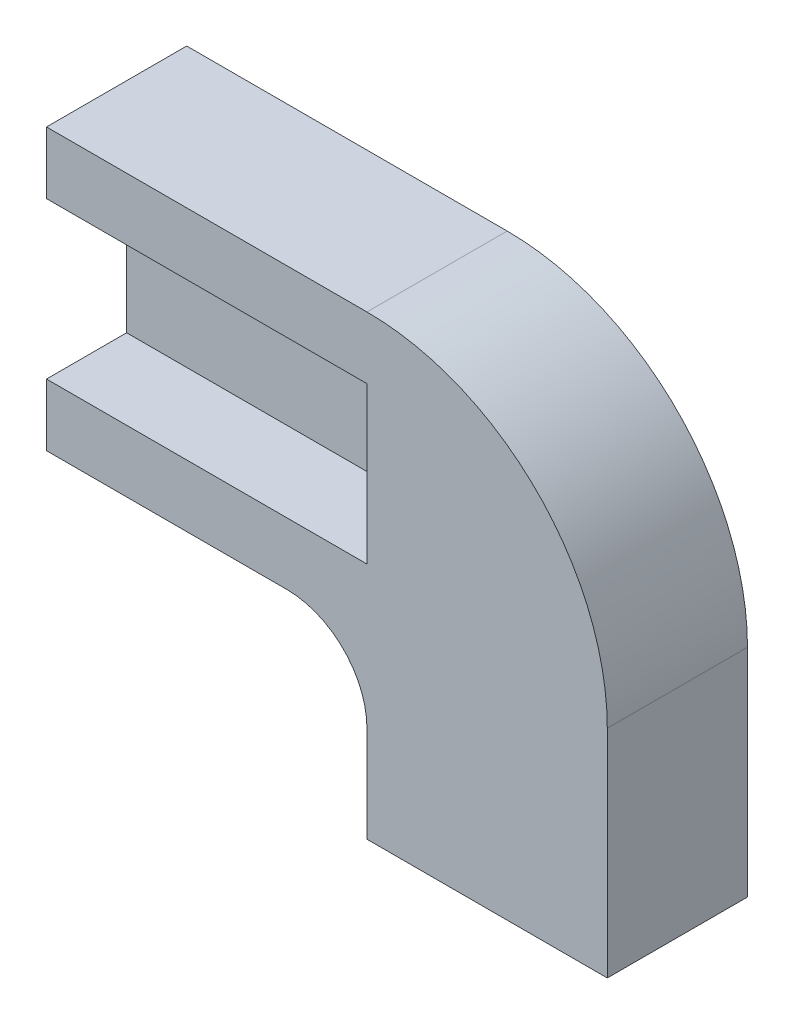
ISO-10303-21;
HEADER;
FILE_DESCRIPTION(('STEP AP214'),'2;1');
FILE_NAME('part.step','',(''),(''),'','','');
FILE_SCHEMA(('AUTOMOTIVE_DESIGN { 1 0 10303 214 1 1 1 1 }'));
ENDSEC;
DATA;
#1=APPLICATION_CONTEXT('core data for automotive mechanical design processes');
#2=APPLICATION_PROTOCOL_DEFINITION('international standard','automotive_design',2000,#1);
#3=PRODUCT_CONTEXT('',#1,'mechanical');
#4=PRODUCT('Part','Part','',(#3));
#5=PRODUCT_RELATED_PRODUCT_CATEGORY('part','',(#4));
#6=PRODUCT_DEFINITION_FORMATION('','',#4);
#7=PRODUCT_DEFINITION_CONTEXT('part definition',#1,'design');
#8=PRODUCT_DEFINITION('design','',#6,#7);
#9=PRODUCT_DEFINITION_SHAPE('','',#8);
#10=(LENGTH_UNIT() NAMED_UNIT(*) SI_UNIT(.MILLI.,.METRE.));
#11=(NAMED_UNIT(*) PLANE_ANGLE_UNIT() SI_UNIT($,.RADIAN.));
#12=(NAMED_UNIT(*) SI_UNIT($,.STERADIAN.) SOLID_ANGLE_UNIT());
#13=UNCERTAINTY_MEASURE_WITH_UNIT(LENGTH_MEASURE(1.E-05),#10,'distance_accuracy_value','');
#14=(GEOMETRIC_REPRESENTATION_CONTEXT(3) GLOBAL_UNCERTAINTY_ASSIGNED_CONTEXT((#13)) GLOBAL_UNIT_ASSIGNED_CONTEXT((#10,
#11,#12)) REPRESENTATION_CONTEXT('',''));
#15=CARTESIAN_POINT('',(0.,0.,0.));
#16=DIRECTION('',(0.,0.,1.));
#17=DIRECTION('',(1.,0.,0.));
#18=AXIS2_PLACEMENT_3D('',#15,#16,#17);
#19=CARTESIAN_POINT('',(17.78,0.,0.));
#20=DIRECTION('',(0.,1.,0.));
#21=DIRECTION('',(0.,0.,1.));
#22=AXIS2_PLACEMENT_3D('',#19,#20,#21);
#23=PLANE('',#22);
#24=DIRECTION('',(-1.,0.,0.));
#25=VECTOR('',#24,1.);
#26=CARTESIAN_POINT('',(17.78,0.,4.445));
#27=LINE('',#26,#25);
#28=CARTESIAN_POINT('',(10.16,0.,4.445));
#29=VERTEX_POINT('',#28);
#30=CARTESIAN_POINT('',(0.,0.,4.445));
#31=VERTEX_POINT('',#30);
#32=EDGE_CURVE('E172',#29,#31,#27,.T.);
#33=ORIENTED_EDGE('',*,*,#32,.F.);
#34=DIRECTION('',(0.,0.,1.));
#35=VECTOR('',#34,1.);
#36=CARTESIAN_POINT('',(10.16,0.,0.));
#37=LINE('',#36,#35);
#38=CARTESIAN_POINT('',(10.16,0.,0.));
#39=VERTEX_POINT('',#38);
#40=EDGE_CURVE('E41',#29,#39,#37,.F.);
#41=ORIENTED_EDGE('',*,*,#40,.T.);
#42=DIRECTION('',(-1.,0.,0.));
#43=VECTOR('',#42,1.);
#44=CARTESIAN_POINT('',(17.78,0.,0.));
#45=LINE('',#44,#43);
#46=CARTESIAN_POINT('',(0.,0.,0.));
#47=VERTEX_POINT('',#46);
#48=EDGE_CURVE('E174',#39,#47,#45,.T.);
#49=ORIENTED_EDGE('',*,*,#48,.T.);
#50=DIRECTION('',(0.,0.,1.));
#51=VECTOR('',#50,1.);
#52=CARTESIAN_POINT('',(0.,0.,0.));
#53=LINE('',#52,#51);
#54=EDGE_CURVE('E185',#47,#31,#53,.T.);
#55=ORIENTED_EDGE('',*,*,#54,.T.);
#56=EDGE_LOOP('',(#33,#41,#49,#55));
#57=FACE_BOUND('',#56,.T.);
#58=ADVANCED_FACE('F33',(#57),#23,.T.);
#59=CARTESIAN_POINT('',(17.78,-14.478,0.));
#60=DIRECTION('',(1.,0.,0.));
#61=DIRECTION('',(0.,0.,-1.));
#62=AXIS2_PLACEMENT_3D('',#59,#60,#61);
#63=PLANE('',#62);
#64=DIRECTION('',(0.,1.,0.));
#65=VECTOR('',#64,1.);
#66=CARTESIAN_POINT('',(17.78,-14.478,0.));
#67=LINE('',#66,#65);
#68=CARTESIAN_POINT('',(17.78,-14.478,0.));
#69=VERTEX_POINT('',#68);
#70=CARTESIAN_POINT('',(17.78,-7.62,0.));
#71=VERTEX_POINT('',#70);
#72=EDGE_CURVE('E182',#69,#71,#67,.T.);
#73=ORIENTED_EDGE('',*,*,#72,.T.);
#74=DIRECTION('',(0.,0.,1.));
#75=VECTOR('',#74,1.);
#76=CARTESIAN_POINT('',(17.78,-7.62,0.));
#77=LINE('',#76,#75);
#78=CARTESIAN_POINT('',(17.78,-7.62,4.445));
#79=VERTEX_POINT('',#78);
#80=EDGE_CURVE('E208',#71,#79,#77,.T.);
#81=ORIENTED_EDGE('',*,*,#80,.T.);
#82=DIRECTION('',(0.,1.,0.));
#83=VECTOR('',#82,1.);
#84=CARTESIAN_POINT('',(17.78,-14.478,4.445));
#85=LINE('',#84,#83);
#86=CARTESIAN_POINT('',(17.78,-14.478,4.445));
#87=VERTEX_POINT('',#86);
#88=EDGE_CURVE('E177',#87,#79,#85,.T.);
#89=ORIENTED_EDGE('',*,*,#88,.F.);
#90=DIRECTION('',(0.,0.,1.));
#91=VECTOR('',#90,1.);
#92=CARTESIAN_POINT('',(17.78,-14.478,0.));
#93=LINE('',#92,#91);
#94=EDGE_CURVE('E194',#69,#87,#93,.T.);
#95=ORIENTED_EDGE('',*,*,#94,.F.);
#96=EDGE_LOOP('',(#73,#81,#89,#95));
#97=FACE_BOUND('',#96,.T.);
#98=ADVANCED_FACE('F214',(#97),#63,.T.);
#99=CARTESIAN_POINT('',(0.,-14.478,0.));
#100=DIRECTION('',(0.,-1.,0.));
#101=DIRECTION('',(1.,0.,0.));
#102=AXIS2_PLACEMENT_3D('',#99,#100,#101);
#103=PLANE('',#102);
#104=DIRECTION('',(0.,0.,-1.));
#105=VECTOR('',#104,1.);
#106=CARTESIAN_POINT('',(10.16,-14.478,4.445));
#107=LINE('',#106,#105);
#108=CARTESIAN_POINT('',(10.16,-14.478,4.445));
#109=VERTEX_POINT('',#108);
#110=CARTESIAN_POINT('',(10.16,-14.478,0.));
#111=VERTEX_POINT('',#110);
#112=EDGE_CURVE('E169',#109,#111,#107,.T.);
#113=ORIENTED_EDGE('',*,*,#112,.T.);
#114=DIRECTION('',(1.,0.,0.));
#115=VECTOR('',#114,1.);
#116=CARTESIAN_POINT('',(0.,-14.478,0.));
#117=LINE('',#116,#115);
#118=EDGE_CURVE('E180',#111,#69,#117,.T.);
#119=ORIENTED_EDGE('',*,*,#118,.T.);
#120=ORIENTED_EDGE('',*,*,#94,.T.);
#121=DIRECTION('',(1.,0.,0.));
#122=VECTOR('',#121,1.);
#123=CARTESIAN_POINT('',(0.,-14.478,4.445));
#124=LINE('',#123,#122);
#125=EDGE_CURVE('E191',#109,#87,#124,.T.);
#126=ORIENTED_EDGE('',*,*,#125,.F.);
#127=EDGE_LOOP('',(#113,#119,#120,#126));
#128=FACE_BOUND('',#127,.T.);
#129=ADVANCED_FACE('F224',(#128),#103,.T.);
#130=CARTESIAN_POINT('',(0.,0.,0.));
#131=DIRECTION('',(-1.,0.,0.));
#132=DIRECTION('',(0.,0.,1.));
#133=AXIS2_PLACEMENT_3D('',#130,#131,#132);
#134=PLANE('',#133);
#135=DIRECTION('',(0.,0.,1.));
#136=VECTOR('',#135,1.);
#137=CARTESIAN_POINT('',(0.,-6.9215,1.905));
#138=LINE('',#137,#136);
#139=CARTESIAN_POINT('',(0.,-6.9215,1.905));
#140=VERTEX_POINT('',#139);
#141=CARTESIAN_POINT('',(0.,-6.9215,4.445));
#142=VERTEX_POINT('',#141);
#143=EDGE_CURVE('E156',#140,#142,#138,.T.);
#144=ORIENTED_EDGE('',*,*,#143,.F.);
#145=DIRECTION('',(0.,-1.,0.));
#146=VECTOR('',#145,1.);
#147=CARTESIAN_POINT('',(0.,-1.9685,1.905));
#148=LINE('',#147,#146);
#149=CARTESIAN_POINT('',(0.,-1.9685,1.905));
#150=VERTEX_POINT('',#149);
#151=EDGE_CURVE('E139',#150,#140,#148,.T.);
#152=ORIENTED_EDGE('',*,*,#151,.F.);
#153=DIRECTION('',(0.,0.,1.));
#154=VECTOR('',#153,1.);
#155=CARTESIAN_POINT('',(0.,-1.9685,1.905));
#156=LINE('',#155,#154);
#157=CARTESIAN_POINT('',(0.,-1.9685,4.445));
#158=VERTEX_POINT('',#157);
#159=EDGE_CURVE('E130',#150,#158,#156,.T.);
#160=ORIENTED_EDGE('',*,*,#159,.T.);
#161=DIRECTION('',(0.,-1.,0.));
#162=VECTOR('',#161,1.);
#163=CARTESIAN_POINT('',(0.,0.,4.445));
#164=LINE('',#163,#162);
#165=EDGE_CURVE('E188',#31,#158,#164,.T.);
#166=ORIENTED_EDGE('',*,*,#165,.F.);
#167=ORIENTED_EDGE('',*,*,#54,.F.);
#168=DIRECTION('',(0.,-1.,0.));
#169=VECTOR('',#168,1.);
#170=CARTESIAN_POINT('',(0.,0.,0.));
#171=LINE('',#170,#169);
#172=CARTESIAN_POINT('',(0.,-8.89,0.));
#173=VERTEX_POINT('',#172);
#174=EDGE_CURVE('E176',#47,#173,#171,.T.);
#175=ORIENTED_EDGE('',*,*,#174,.T.);
#176=DIRECTION('',(0.,0.,-1.));
#177=VECTOR('',#176,1.);
#178=CARTESIAN_POINT('',(0.,-8.89,4.445));
#179=LINE('',#178,#177);
#180=CARTESIAN_POINT('',(0.,-8.89,4.445));
#181=VERTEX_POINT('',#180);
#182=EDGE_CURVE('E165',#181,#173,#179,.T.);
#183=ORIENTED_EDGE('',*,*,#182,.F.);
#184=EDGE_CURVE('E187',#142,#181,#164,.T.);
#185=ORIENTED_EDGE('',*,*,#184,.F.);
#186=EDGE_LOOP('',(#144,#152,#160,#166,#167,#175,#183,#185));
#187=FACE_BOUND('',#186,.T.);
#188=ADVANCED_FACE('F243',(#187),#134,.T.);
#189=CARTESIAN_POINT('',(0.,0.,0.));
#190=DIRECTION('',(0.,0.,1.));
#191=DIRECTION('',(1.,0.,0.));
#192=AXIS2_PLACEMENT_3D('',#189,#190,#191);
#193=PLANE('',#192);
#194=ORIENTED_EDGE('',*,*,#48,.F.);
#195=CARTESIAN_POINT('',(10.16,-7.62,0.));
#196=DIRECTION('',(0.,0.,1.));
#197=DIRECTION('',(1.,0.,0.));
#198=AXIS2_PLACEMENT_3D('',#195,#196,#197);
#199=CIRCLE('',#198,7.62);
#200=EDGE_CURVE('E11',#39,#71,#199,.F.);
#201=ORIENTED_EDGE('',*,*,#200,.T.);
#202=ORIENTED_EDGE('',*,*,#72,.F.);
#203=ORIENTED_EDGE('',*,*,#118,.F.);
#204=DIRECTION('',(0.,-1.,0.));
#205=VECTOR('',#204,1.);
#206=CARTESIAN_POINT('',(10.16,-8.89,0.));
#207=LINE('',#206,#205);
#208=CARTESIAN_POINT('',(10.16,-11.43,0.));
#209=VERTEX_POINT('',#208);
#210=EDGE_CURVE('E163',#209,#111,#207,.T.);
#211=ORIENTED_EDGE('',*,*,#210,.F.);
#212=CARTESIAN_POINT('',(7.62,-11.43,0.));
#213=DIRECTION('',(0.,0.,1.));
#214=DIRECTION('',(1.,0.,0.));
#215=AXIS2_PLACEMENT_3D('',#212,#213,#214);
#216=CIRCLE('',#215,2.54);
#217=CARTESIAN_POINT('',(7.62,-8.89,0.));
#218=VERTEX_POINT('',#217);
#219=EDGE_CURVE('E204',#209,#218,#216,.T.);
#220=ORIENTED_EDGE('',*,*,#219,.T.);
#221=DIRECTION('',(1.,0.,0.));
#222=VECTOR('',#221,1.);
#223=CARTESIAN_POINT('',(0.,-8.89,0.));
#224=LINE('',#223,#222);
#225=EDGE_CURVE('E155',#173,#218,#224,.T.);
#226=ORIENTED_EDGE('',*,*,#225,.F.);
#227=ORIENTED_EDGE('',*,*,#174,.F.);
#228=EDGE_LOOP('',(#194,#201,#202,#203,#211,#220,#226,#227));
#229=FACE_BOUND('',#228,.T.);
#230=ADVANCED_FACE('F227',(#229),#193,.F.);
#231=CARTESIAN_POINT('',(0.,0.,4.445));
#232=DIRECTION('',(0.,0.,1.));
#233=DIRECTION('',(1.,0.,0.));
#234=AXIS2_PLACEMENT_3D('',#231,#232,#233);
#235=PLANE('',#234);
#236=ORIENTED_EDGE('',*,*,#88,.T.);
#237=CARTESIAN_POINT('',(10.16,-7.62,4.445));
#238=DIRECTION('',(0.,0.,1.));
#239=DIRECTION('',(1.,0.,0.));
#240=AXIS2_PLACEMENT_3D('',#237,#238,#239);
#241=CIRCLE('',#240,7.62);
#242=EDGE_CURVE('E55',#79,#29,#241,.T.);
#243=ORIENTED_EDGE('',*,*,#242,.T.);
#244=ORIENTED_EDGE('',*,*,#32,.T.);
#245=ORIENTED_EDGE('',*,*,#165,.T.);
#246=DIRECTION('',(-1.,0.,0.));
#247=VECTOR('',#246,1.);
#248=CARTESIAN_POINT('',(10.16,-1.9685,4.445));
#249=LINE('',#248,#247);
#250=CARTESIAN_POINT('',(10.16,-1.9685,4.445));
#251=VERTEX_POINT('',#250);
#252=EDGE_CURVE('E146',#251,#158,#249,.T.);
#253=ORIENTED_EDGE('',*,*,#252,.F.);
#254=DIRECTION('',(0.,1.,0.));
#255=VECTOR('',#254,1.);
#256=CARTESIAN_POINT('',(10.16,-6.9215,4.445));
#257=LINE('',#256,#255);
#258=CARTESIAN_POINT('',(10.16,-6.9215,4.445));
#259=VERTEX_POINT('',#258);
#260=EDGE_CURVE('E127',#259,#251,#257,.T.);
#261=ORIENTED_EDGE('',*,*,#260,.F.);
#262=DIRECTION('',(1.,0.,0.));
#263=VECTOR('',#262,1.);
#264=CARTESIAN_POINT('',(0.,-6.9215,4.445));
#265=LINE('',#264,#263);
#266=EDGE_CURVE('E143',#142,#259,#265,.T.);
#267=ORIENTED_EDGE('',*,*,#266,.F.);
#268=ORIENTED_EDGE('',*,*,#184,.T.);
#269=DIRECTION('',(1.,0.,0.));
#270=VECTOR('',#269,1.);
#271=CARTESIAN_POINT('',(0.,-8.89,4.445));
#272=LINE('',#271,#270);
#273=CARTESIAN_POINT('',(7.62,-8.89,4.445));
#274=VERTEX_POINT('',#273);
#275=EDGE_CURVE('E159',#181,#274,#272,.T.);
#276=ORIENTED_EDGE('',*,*,#275,.T.);
#277=CARTESIAN_POINT('',(7.62,-11.43,4.445));
#278=DIRECTION('',(0.,0.,1.));
#279=DIRECTION('',(1.,0.,0.));
#280=AXIS2_PLACEMENT_3D('',#277,#278,#279);
#281=CIRCLE('',#280,2.54);
#282=CARTESIAN_POINT('',(10.16,-11.43,4.445));
#283=VERTEX_POINT('',#282);
#284=EDGE_CURVE('E206',#274,#283,#281,.F.);
#285=ORIENTED_EDGE('',*,*,#284,.T.);
#286=DIRECTION('',(0.,-1.,0.));
#287=VECTOR('',#286,1.);
#288=CARTESIAN_POINT('',(10.16,-8.89,4.445));
#289=LINE('',#288,#287);
#290=EDGE_CURVE('E162',#283,#109,#289,.T.);
#291=ORIENTED_EDGE('',*,*,#290,.T.);
#292=ORIENTED_EDGE('',*,*,#125,.T.);
#293=EDGE_LOOP('',(#236,#243,#244,#245,#253,#261,#267,#268,#276,#285,#291,#292));
#294=FACE_BOUND('',#293,.T.);
#295=ADVANCED_FACE('F219',(#294),#235,.T.);
#296=CARTESIAN_POINT('',(10.16,-8.89,4.445));
#297=DIRECTION('',(1.,0.,0.));
#298=DIRECTION('',(0.,0.,-1.));
#299=AXIS2_PLACEMENT_3D('',#296,#297,#298);
#300=PLANE('',#299);
#301=ORIENTED_EDGE('',*,*,#290,.F.);
#302=DIRECTION('',(0.,0.,-1.));
#303=VECTOR('',#302,1.);
#304=CARTESIAN_POINT('',(10.16,-11.43,0.));
#305=LINE('',#304,#303);
#306=EDGE_CURVE('E197',#283,#209,#305,.T.);
#307=ORIENTED_EDGE('',*,*,#306,.T.);
#308=ORIENTED_EDGE('',*,*,#210,.T.);
#309=ORIENTED_EDGE('',*,*,#112,.F.);
#310=EDGE_LOOP('',(#301,#307,#308,#309));
#311=FACE_BOUND('',#310,.T.);
#312=ADVANCED_FACE('F251',(#311),#300,.F.);
#313=CARTESIAN_POINT('',(0.,-8.89,4.445));
#314=DIRECTION('',(0.,1.,0.));
#315=DIRECTION('',(0.,0.,1.));
#316=AXIS2_PLACEMENT_3D('',#313,#314,#315);
#317=PLANE('',#316);
#318=ORIENTED_EDGE('',*,*,#225,.T.);
#319=DIRECTION('',(0.,0.,-1.));
#320=VECTOR('',#319,1.);
#321=CARTESIAN_POINT('',(7.62,-8.89,4.445));
#322=LINE('',#321,#320);
#323=EDGE_CURVE('E202',#218,#274,#322,.F.);
#324=ORIENTED_EDGE('',*,*,#323,.T.);
#325=ORIENTED_EDGE('',*,*,#275,.F.);
#326=ORIENTED_EDGE('',*,*,#182,.T.);
#327=EDGE_LOOP('',(#318,#324,#325,#326));
#328=FACE_BOUND('',#327,.T.);
#329=ADVANCED_FACE('F254',(#328),#317,.F.);
#330=CARTESIAN_POINT('',(10.16,-6.9215,1.905));
#331=DIRECTION('',(1.,0.,0.));
#332=DIRECTION('',(0.,0.,-1.));
#333=AXIS2_PLACEMENT_3D('',#330,#331,#332);
#334=PLANE('',#333);
#335=ORIENTED_EDGE('',*,*,#260,.T.);
#336=DIRECTION('',(0.,0.,1.));
#337=VECTOR('',#336,1.);
#338=CARTESIAN_POINT('',(10.16,-1.9685,1.905));
#339=LINE('',#338,#337);
#340=CARTESIAN_POINT('',(10.16,-1.9685,1.905));
#341=VERTEX_POINT('',#340);
#342=EDGE_CURVE('E120',#341,#251,#339,.T.);
#343=ORIENTED_EDGE('',*,*,#342,.F.);
#344=DIRECTION('',(0.,1.,0.));
#345=VECTOR('',#344,1.);
#346=CARTESIAN_POINT('',(10.16,-6.9215,1.905));
#347=LINE('',#346,#345);
#348=CARTESIAN_POINT('',(10.16,-6.9215,1.905));
#349=VERTEX_POINT('',#348);
#350=EDGE_CURVE('E124',#349,#341,#347,.T.);
#351=ORIENTED_EDGE('',*,*,#350,.F.);
#352=DIRECTION('',(0.,0.,1.));
#353=VECTOR('',#352,1.);
#354=CARTESIAN_POINT('',(10.16,-6.9215,1.905));
#355=LINE('',#354,#353);
#356=EDGE_CURVE('E153',#349,#259,#355,.T.);
#357=ORIENTED_EDGE('',*,*,#356,.T.);
#358=EDGE_LOOP('',(#335,#343,#351,#357));
#359=FACE_BOUND('',#358,.T.);
#360=ADVANCED_FACE('F122',(#359),#334,.F.);
#361=CARTESIAN_POINT('',(0.,-6.9215,1.905));
#362=DIRECTION('',(0.,-1.,0.));
#363=DIRECTION('',(1.,0.,0.));
#364=AXIS2_PLACEMENT_3D('',#361,#362,#363);
#365=PLANE('',#364);
#366=ORIENTED_EDGE('',*,*,#266,.T.);
#367=ORIENTED_EDGE('',*,*,#356,.F.);
#368=DIRECTION('',(1.,0.,0.));
#369=VECTOR('',#368,1.);
#370=CARTESIAN_POINT('',(0.,-6.9215,1.905));
#371=LINE('',#370,#369);
#372=EDGE_CURVE('E131',#140,#349,#371,.T.);
#373=ORIENTED_EDGE('',*,*,#372,.F.);
#374=ORIENTED_EDGE('',*,*,#143,.T.);
#375=EDGE_LOOP('',(#366,#367,#373,#374));
#376=FACE_BOUND('',#375,.T.);
#377=ADVANCED_FACE('F263',(#376),#365,.F.);
#378=CARTESIAN_POINT('',(10.16,-1.9685,1.905));
#379=DIRECTION('',(0.,1.,0.));
#380=DIRECTION('',(-1.,0.,0.));
#381=AXIS2_PLACEMENT_3D('',#378,#379,#380);
#382=PLANE('',#381);
#383=ORIENTED_EDGE('',*,*,#252,.T.);
#384=ORIENTED_EDGE('',*,*,#159,.F.);
#385=DIRECTION('',(-1.,0.,0.));
#386=VECTOR('',#385,1.);
#387=CARTESIAN_POINT('',(10.16,-1.9685,1.905));
#388=LINE('',#387,#386);
#389=EDGE_CURVE('E134',#341,#150,#388,.T.);
#390=ORIENTED_EDGE('',*,*,#389,.F.);
#391=ORIENTED_EDGE('',*,*,#342,.T.);
#392=EDGE_LOOP('',(#383,#384,#390,#391));
#393=FACE_BOUND('',#392,.T.);
#394=ADVANCED_FACE('F135',(#393),#382,.F.);
#395=CARTESIAN_POINT('',(0.,0.,1.905));
#396=DIRECTION('',(0.,0.,1.));
#397=DIRECTION('',(1.,0.,0.));
#398=AXIS2_PLACEMENT_3D('',#395,#396,#397);
#399=PLANE('',#398);
#400=ORIENTED_EDGE('',*,*,#350,.T.);
#401=ORIENTED_EDGE('',*,*,#389,.T.);
#402=ORIENTED_EDGE('',*,*,#151,.T.);
#403=ORIENTED_EDGE('',*,*,#372,.T.);
#404=EDGE_LOOP('',(#400,#401,#402,#403));
#405=FACE_BOUND('',#404,.T.);
#406=ADVANCED_FACE('F141',(#405),#399,.T.);
#407=CARTESIAN_POINT('',(7.62,-11.43,4.445));
#408=DIRECTION('',(0.,0.,1.));
#409=DIRECTION('',(1.,0.,0.));
#410=AXIS2_PLACEMENT_3D('',#407,#408,#409);
#411=CYLINDRICAL_SURFACE('',#410,2.54);
#412=ORIENTED_EDGE('',*,*,#284,.F.);
#413=ORIENTED_EDGE('',*,*,#323,.F.);
#414=ORIENTED_EDGE('',*,*,#219,.F.);
#415=ORIENTED_EDGE('',*,*,#306,.F.);
#416=EDGE_LOOP('',(#412,#413,#414,#415));
#417=FACE_BOUND('',#416,.T.);
#418=ADVANCED_FACE('F231',(#417),#411,.F.);
#419=CARTESIAN_POINT('',(10.16,-7.62,0.));
#420=DIRECTION('',(0.,0.,1.));
#421=DIRECTION('',(1.,0.,0.));
#422=AXIS2_PLACEMENT_3D('',#419,#420,#421);
#423=CYLINDRICAL_SURFACE('',#422,7.62);
#424=ORIENTED_EDGE('',*,*,#200,.F.);
#425=ORIENTED_EDGE('',*,*,#40,.F.);
#426=ORIENTED_EDGE('',*,*,#242,.F.);
#427=ORIENTED_EDGE('',*,*,#80,.F.);
#428=EDGE_LOOP('',(#424,#425,#426,#427));
#429=FACE_BOUND('',#428,.T.);
#430=ADVANCED_FACE('F35',(#429),#423,.T.);
#431=CLOSED_SHELL('',(#58,#98,#129,#188,#230,#295,#312,#329,#360,#377,#394,#406,#418,#430));
#432=MANIFOLD_SOLID_BREP('B2',#431);
#433=ADVANCED_BREP_SHAPE_REPRESENTATION('',(#18,#432),#14);
#434=SHAPE_DEFINITION_REPRESENTATION(#9,#433);
ENDSEC;
END-ISO-10303-21;
